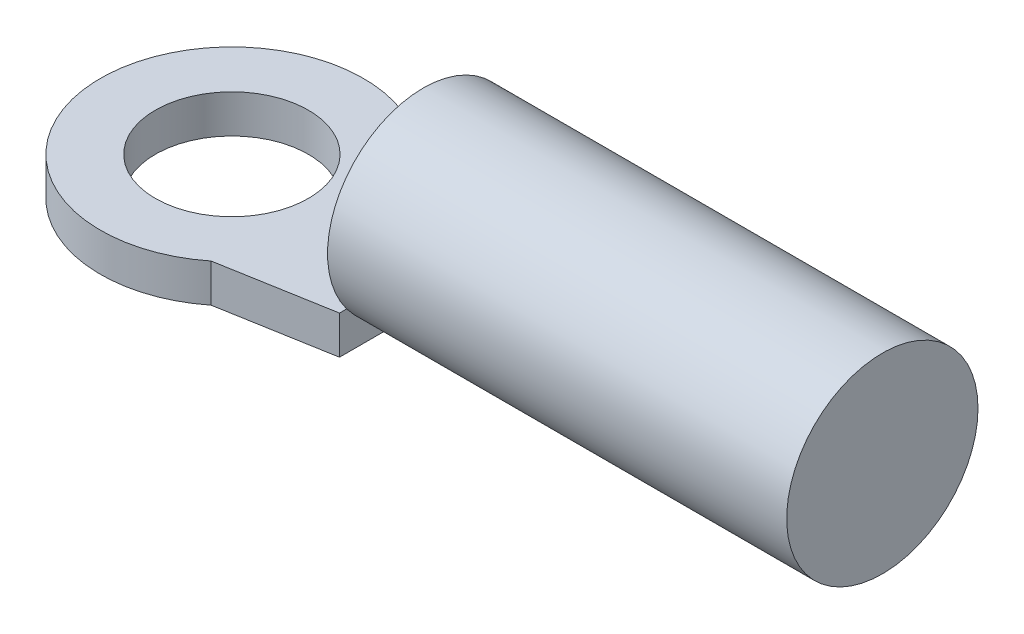
ISO-10303-21;
HEADER;
FILE_DESCRIPTION(('STEP AP214'),'2;1');
FILE_NAME('part.step','',(''),(''),'','','');
FILE_SCHEMA(('AUTOMOTIVE_DESIGN { 1 0 10303 214 1 1 1 1 }'));
ENDSEC;
DATA;
#1=APPLICATION_CONTEXT('core data for automotive mechanical design processes');
#2=APPLICATION_PROTOCOL_DEFINITION('international standard','automotive_design',2000,#1);
#3=PRODUCT_CONTEXT('',#1,'mechanical');
#4=PRODUCT('Part','Part','',(#3));
#5=PRODUCT_RELATED_PRODUCT_CATEGORY('part','',(#4));
#6=PRODUCT_DEFINITION_FORMATION('','',#4);
#7=PRODUCT_DEFINITION_CONTEXT('part definition',#1,'design');
#8=PRODUCT_DEFINITION('design','',#6,#7);
#9=PRODUCT_DEFINITION_SHAPE('','',#8);
#10=(LENGTH_UNIT() NAMED_UNIT(*) SI_UNIT(.MILLI.,.METRE.));
#11=(NAMED_UNIT(*) PLANE_ANGLE_UNIT() SI_UNIT($,.RADIAN.));
#12=(NAMED_UNIT(*) SI_UNIT($,.STERADIAN.) SOLID_ANGLE_UNIT());
#13=UNCERTAINTY_MEASURE_WITH_UNIT(LENGTH_MEASURE(1.E-05),#10,'distance_accuracy_value','');
#14=(GEOMETRIC_REPRESENTATION_CONTEXT(3) GLOBAL_UNCERTAINTY_ASSIGNED_CONTEXT((#13)) GLOBAL_UNIT_ASSIGNED_CONTEXT((#10,
#11,#12)) REPRESENTATION_CONTEXT('',''));
#15=CARTESIAN_POINT('',(0.,0.,0.));
#16=DIRECTION('',(0.,0.,1.));
#17=DIRECTION('',(1.,0.,0.));
#18=AXIS2_PLACEMENT_3D('',#15,#16,#17);
#19=CARTESIAN_POINT('',(4.,0.8,0.));
#20=DIRECTION('',(1.,0.,0.));
#21=DIRECTION('',(0.,0.,-1.));
#22=AXIS2_PLACEMENT_3D('',#19,#20,#21);
#23=PLANE('',#22);
#24=CARTESIAN_POINT('',(4.,2.,0.));
#25=DIRECTION('',(1.,0.,0.));
#26=DIRECTION('',(0.,0.,-1.));
#27=AXIS2_PLACEMENT_3D('',#24,#25,#26);
#28=CIRCLE('',#27,2.);
#29=CARTESIAN_POINT('',(4.,0.8,1.6));
#30=VERTEX_POINT('',#29);
#31=CARTESIAN_POINT('',(4.,0.,0.));
#32=VERTEX_POINT('',#31);
#33=EDGE_CURVE('E47',#30,#32,#28,.T.);
#34=ORIENTED_EDGE('',*,*,#33,.F.);
#35=DIRECTION('',(0.,0.,1.));
#36=VECTOR('',#35,1.);
#37=CARTESIAN_POINT('',(4.,0.8,0.));
#38=LINE('',#37,#36);
#39=CARTESIAN_POINT('',(4.,0.8,1.75));
#40=VERTEX_POINT('',#39);
#41=EDGE_CURVE('E93',#30,#40,#38,.T.);
#42=ORIENTED_EDGE('',*,*,#41,.T.);
#43=DIRECTION('',(0.,-1.,0.));
#44=VECTOR('',#43,1.);
#45=CARTESIAN_POINT('',(4.,0.8,1.75));
#46=LINE('',#45,#44);
#47=CARTESIAN_POINT('',(4.,0.,1.75));
#48=VERTEX_POINT('',#47);
#49=EDGE_CURVE('E118',#40,#48,#46,.T.);
#50=ORIENTED_EDGE('',*,*,#49,.T.);
#51=DIRECTION('',(0.,0.,1.));
#52=VECTOR('',#51,1.);
#53=CARTESIAN_POINT('',(4.,0.,0.));
#54=LINE('',#53,#52);
#55=EDGE_CURVE('E106',#32,#48,#54,.T.);
#56=ORIENTED_EDGE('',*,*,#55,.F.);
#57=EDGE_LOOP('',(#34,#42,#50,#56));
#58=FACE_BOUND('',#57,.T.);
#59=ADVANCED_FACE('F37',(#58),#23,.T.);
#60=CARTESIAN_POINT('',(4.,0.8,-1.6));
#61=VERTEX_POINT('',#60);
#62=EDGE_CURVE('E11',#32,#61,#28,.T.);
#63=ORIENTED_EDGE('',*,*,#62,.F.);
#64=CARTESIAN_POINT('',(4.,0.,-1.75));
#65=VERTEX_POINT('',#64);
#66=EDGE_CURVE('E119',#65,#32,#54,.T.);
#67=ORIENTED_EDGE('',*,*,#66,.F.);
#68=DIRECTION('',(0.,-1.,0.));
#69=VECTOR('',#68,1.);
#70=CARTESIAN_POINT('',(4.,0.8,-1.75));
#71=LINE('',#70,#69);
#72=CARTESIAN_POINT('',(4.,0.8,-1.75));
#73=VERTEX_POINT('',#72);
#74=EDGE_CURVE('E41',#73,#65,#71,.T.);
#75=ORIENTED_EDGE('',*,*,#74,.F.);
#76=EDGE_CURVE('E86',#73,#61,#38,.T.);
#77=ORIENTED_EDGE('',*,*,#76,.T.);
#78=EDGE_LOOP('',(#63,#67,#75,#77));
#79=FACE_BOUND('',#78,.T.);
#80=ADVANCED_FACE('F39',(#79),#23,.T.);
#81=CARTESIAN_POINT('',(0.416089419203324,0.8,-2.37728235429973));
#82=DIRECTION('',(-0.17240646700263,0.,0.985025893129552));
#83=DIRECTION('',(0.985025893129552,0.,0.17240646700263));
#84=AXIS2_PLACEMENT_3D('',#81,#82,#83);
#85=PLANE('',#84);
#86=DIRECTION('',(-0.985025893129552,0.,-0.17240646700263));
#87=VECTOR('',#86,1.);
#88=CARTESIAN_POINT('',(0.416089419203324,0.,-2.37728235429973));
#89=LINE('',#88,#87);
#90=CARTESIAN_POINT('',(1.71464281994822,0.,-2.15));
#91=VERTEX_POINT('',#90);
#92=EDGE_CURVE('E122',#65,#91,#89,.T.);
#93=ORIENTED_EDGE('',*,*,#92,.T.);
#94=DIRECTION('',(0.,-1.,0.));
#95=VECTOR('',#94,1.);
#96=CARTESIAN_POINT('',(1.71464281994822,0.8,-2.15));
#97=LINE('',#96,#95);
#98=CARTESIAN_POINT('',(1.71464281994822,0.8,-2.15));
#99=VERTEX_POINT('',#98);
#100=EDGE_CURVE('E136',#99,#91,#97,.T.);
#101=ORIENTED_EDGE('',*,*,#100,.F.);
#102=DIRECTION('',(-0.985025893129552,0.,-0.17240646700263));
#103=VECTOR('',#102,1.);
#104=CARTESIAN_POINT('',(0.416089419203324,0.8,-2.37728235429973));
#105=LINE('',#104,#103);
#106=EDGE_CURVE('E90',#73,#99,#105,.T.);
#107=ORIENTED_EDGE('',*,*,#106,.F.);
#108=ORIENTED_EDGE('',*,*,#74,.T.);
#109=EDGE_LOOP('',(#93,#101,#107,#108));
#110=FACE_BOUND('',#109,.T.);
#111=ADVANCED_FACE('F144',(#110),#85,.F.);
#112=CARTESIAN_POINT('',(0.,0.8,0.));
#113=DIRECTION('',(0.,-1.,0.));
#114=DIRECTION('',(0.,0.,-1.));
#115=AXIS2_PLACEMENT_3D('',#112,#113,#114);
#116=CYLINDRICAL_SURFACE('',#115,2.75);
#117=CARTESIAN_POINT('',(0.,0.,0.));
#118=DIRECTION('',(0.,1.,0.));
#119=DIRECTION('',(0.,0.,1.));
#120=AXIS2_PLACEMENT_3D('',#117,#118,#119);
#121=CIRCLE('',#120,2.75);
#122=CARTESIAN_POINT('',(1.71464281994822,0.,2.15));
#123=VERTEX_POINT('',#122);
#124=EDGE_CURVE('E124',#91,#123,#121,.T.);
#125=ORIENTED_EDGE('',*,*,#124,.T.);
#126=DIRECTION('',(0.,-1.,0.));
#127=VECTOR('',#126,1.);
#128=CARTESIAN_POINT('',(1.71464281994822,0.8,2.15));
#129=LINE('',#128,#127);
#130=CARTESIAN_POINT('',(1.71464281994822,0.8,2.15));
#131=VERTEX_POINT('',#130);
#132=EDGE_CURVE('E135',#131,#123,#129,.T.);
#133=ORIENTED_EDGE('',*,*,#132,.F.);
#134=CARTESIAN_POINT('',(0.,0.8,0.));
#135=DIRECTION('',(0.,1.,0.));
#136=DIRECTION('',(0.,0.,1.));
#137=AXIS2_PLACEMENT_3D('',#134,#135,#136);
#138=CIRCLE('',#137,2.75);
#139=EDGE_CURVE('E110',#99,#131,#138,.T.);
#140=ORIENTED_EDGE('',*,*,#139,.F.);
#141=ORIENTED_EDGE('',*,*,#100,.T.);
#142=EDGE_LOOP('',(#125,#133,#140,#141));
#143=FACE_BOUND('',#142,.T.);
#144=ADVANCED_FACE('F150',(#143),#116,.T.);
#145=CARTESIAN_POINT('',(0.416089419203326,0.8,2.37728235429973));
#146=DIRECTION('',(0.172406467002631,0.,0.985025893129552));
#147=DIRECTION('',(0.985025893129552,0.,-0.172406467002631));
#148=AXIS2_PLACEMENT_3D('',#145,#146,#147);
#149=PLANE('',#148);
#150=DIRECTION('',(-0.985025893129552,0.,0.172406467002631));
#151=VECTOR('',#150,1.);
#152=CARTESIAN_POINT('',(0.416089419203326,0.,2.37728235429973));
#153=LINE('',#152,#151);
#154=EDGE_CURVE('E127',#48,#123,#153,.T.);
#155=ORIENTED_EDGE('',*,*,#154,.F.);
#156=ORIENTED_EDGE('',*,*,#49,.F.);
#157=DIRECTION('',(-0.985025893129552,0.,0.172406467002631));
#158=VECTOR('',#157,1.);
#159=CARTESIAN_POINT('',(0.416089419203326,0.8,2.37728235429973));
#160=LINE('',#159,#158);
#161=EDGE_CURVE('E112',#40,#131,#160,.T.);
#162=ORIENTED_EDGE('',*,*,#161,.T.);
#163=ORIENTED_EDGE('',*,*,#132,.T.);
#164=EDGE_LOOP('',(#155,#156,#162,#163));
#165=FACE_BOUND('',#164,.T.);
#166=ADVANCED_FACE('F153',(#165),#149,.T.);
#167=CARTESIAN_POINT('',(0.,0.8,0.));
#168=DIRECTION('',(0.,-1.,0.));
#169=DIRECTION('',(0.,0.,-1.));
#170=AXIS2_PLACEMENT_3D('',#167,#168,#169);
#171=CYLINDRICAL_SURFACE('',#170,1.6);
#172=CARTESIAN_POINT('',(0.,0.8,0.));
#173=DIRECTION('',(0.,1.,0.));
#174=DIRECTION('',(0.,0.,1.));
#175=AXIS2_PLACEMENT_3D('',#172,#173,#174);
#176=CIRCLE('',#175,1.6);
#177=CARTESIAN_POINT('',(0.,0.8,1.6));
#178=VERTEX_POINT('',#177);
#179=EDGE_CURVE('E115',#178,#178,#176,.T.);
#180=ORIENTED_EDGE('',*,*,#179,.T.);
#181=EDGE_LOOP('',(#180));
#182=FACE_BOUND('',#181,.T.);
#183=CARTESIAN_POINT('',(0.,0.,0.));
#184=DIRECTION('',(0.,1.,0.));
#185=DIRECTION('',(0.,0.,1.));
#186=AXIS2_PLACEMENT_3D('',#183,#184,#185);
#187=CIRCLE('',#186,1.6);
#188=CARTESIAN_POINT('',(0.,0.,1.6));
#189=VERTEX_POINT('',#188);
#190=EDGE_CURVE('E130',#189,#189,#187,.T.);
#191=ORIENTED_EDGE('',*,*,#190,.F.);
#192=EDGE_LOOP('',(#191));
#193=FACE_BOUND('',#192,.T.);
#194=ADVANCED_FACE('F168',(#182,#193),#171,.F.);
#195=CARTESIAN_POINT('',(0.,0.8,0.));
#196=DIRECTION('',(0.,1.,0.));
#197=DIRECTION('',(0.,0.,1.));
#198=AXIS2_PLACEMENT_3D('',#195,#196,#197);
#199=PLANE('',#198);
#200=ORIENTED_EDGE('',*,*,#76,.F.);
#201=ORIENTED_EDGE('',*,*,#106,.T.);
#202=ORIENTED_EDGE('',*,*,#139,.T.);
#203=ORIENTED_EDGE('',*,*,#161,.F.);
#204=ORIENTED_EDGE('',*,*,#41,.F.);
#205=EDGE_CURVE('E91',#61,#30,#38,.T.);
#206=ORIENTED_EDGE('',*,*,#205,.F.);
#207=EDGE_LOOP('',(#200,#201,#202,#203,#204,#206));
#208=FACE_BOUND('',#207,.T.);
#209=ORIENTED_EDGE('',*,*,#179,.F.);
#210=EDGE_LOOP('',(#209));
#211=FACE_BOUND('',#210,.T.);
#212=ADVANCED_FACE('F96',(#208,#211),#199,.T.);
#213=CARTESIAN_POINT('',(0.,0.,0.));
#214=DIRECTION('',(0.,1.,0.));
#215=DIRECTION('',(0.,0.,1.));
#216=AXIS2_PLACEMENT_3D('',#213,#214,#215);
#217=PLANE('',#216);
#218=ORIENTED_EDGE('',*,*,#66,.T.);
#219=ORIENTED_EDGE('',*,*,#55,.T.);
#220=ORIENTED_EDGE('',*,*,#154,.T.);
#221=ORIENTED_EDGE('',*,*,#124,.F.);
#222=ORIENTED_EDGE('',*,*,#92,.F.);
#223=EDGE_LOOP('',(#218,#219,#220,#221,#222));
#224=FACE_BOUND('',#223,.T.);
#225=ORIENTED_EDGE('',*,*,#190,.T.);
#226=EDGE_LOOP('',(#225));
#227=FACE_BOUND('',#226,.T.);
#228=ADVANCED_FACE('F146',(#224,#227),#217,.F.);
#229=CARTESIAN_POINT('',(4.,2.,0.));
#230=DIRECTION('',(1.,0.,0.));
#231=DIRECTION('',(0.,0.,-1.));
#232=AXIS2_PLACEMENT_3D('',#229,#230,#231);
#233=PLANE('',#232);
#234=EDGE_CURVE('E48',#61,#30,#28,.T.);
#235=ORIENTED_EDGE('',*,*,#234,.F.);
#236=ORIENTED_EDGE('',*,*,#205,.T.);
#237=EDGE_LOOP('',(#235,#236));
#238=FACE_BOUND('',#237,.T.);
#239=ADVANCED_FACE('F101',(#238),#233,.F.);
#240=CARTESIAN_POINT('',(13.6,2.,0.));
#241=DIRECTION('',(-1.,0.,0.));
#242=DIRECTION('',(0.,0.,1.));
#243=AXIS2_PLACEMENT_3D('',#240,#241,#242);
#244=CYLINDRICAL_SURFACE('',#243,2.);
#245=CARTESIAN_POINT('',(13.6,2.,0.));
#246=DIRECTION('',(1.,0.,0.));
#247=DIRECTION('',(0.,0.,-1.));
#248=AXIS2_PLACEMENT_3D('',#245,#246,#247);
#249=CIRCLE('',#248,2.);
#250=CARTESIAN_POINT('',(13.6,2.,-2.));
#251=VERTEX_POINT('',#250);
#252=EDGE_CURVE('E104',#251,#251,#249,.T.);
#253=ORIENTED_EDGE('',*,*,#252,.F.);
#254=EDGE_LOOP('',(#253));
#255=FACE_BOUND('',#254,.T.);
#256=ORIENTED_EDGE('',*,*,#33,.T.);
#257=ORIENTED_EDGE('',*,*,#62,.T.);
#258=ORIENTED_EDGE('',*,*,#234,.T.);
#259=EDGE_LOOP('',(#256,#257,#258));
#260=FACE_BOUND('',#259,.T.);
#261=ADVANCED_FACE('F103',(#255,#260),#244,.T.);
#262=CARTESIAN_POINT('',(13.6,2.,0.));
#263=DIRECTION('',(1.,0.,0.));
#264=DIRECTION('',(0.,0.,-1.));
#265=AXIS2_PLACEMENT_3D('',#262,#263,#264);
#266=PLANE('',#265);
#267=ORIENTED_EDGE('',*,*,#252,.T.);
#268=EDGE_LOOP('',(#267));
#269=FACE_BOUND('',#268,.T.);
#270=ADVANCED_FACE('F178',(#269),#266,.T.);
#271=CLOSED_SHELL('',(#59,#80,#111,#144,#166,#194,#212,#228,#239,#261,#270));
#272=MANIFOLD_SOLID_BREP('B2',#271);
#273=ADVANCED_BREP_SHAPE_REPRESENTATION('',(#18,#272),#14);
#274=SHAPE_DEFINITION_REPRESENTATION(#9,#273);
ENDSEC;
END-ISO-10303-21;
